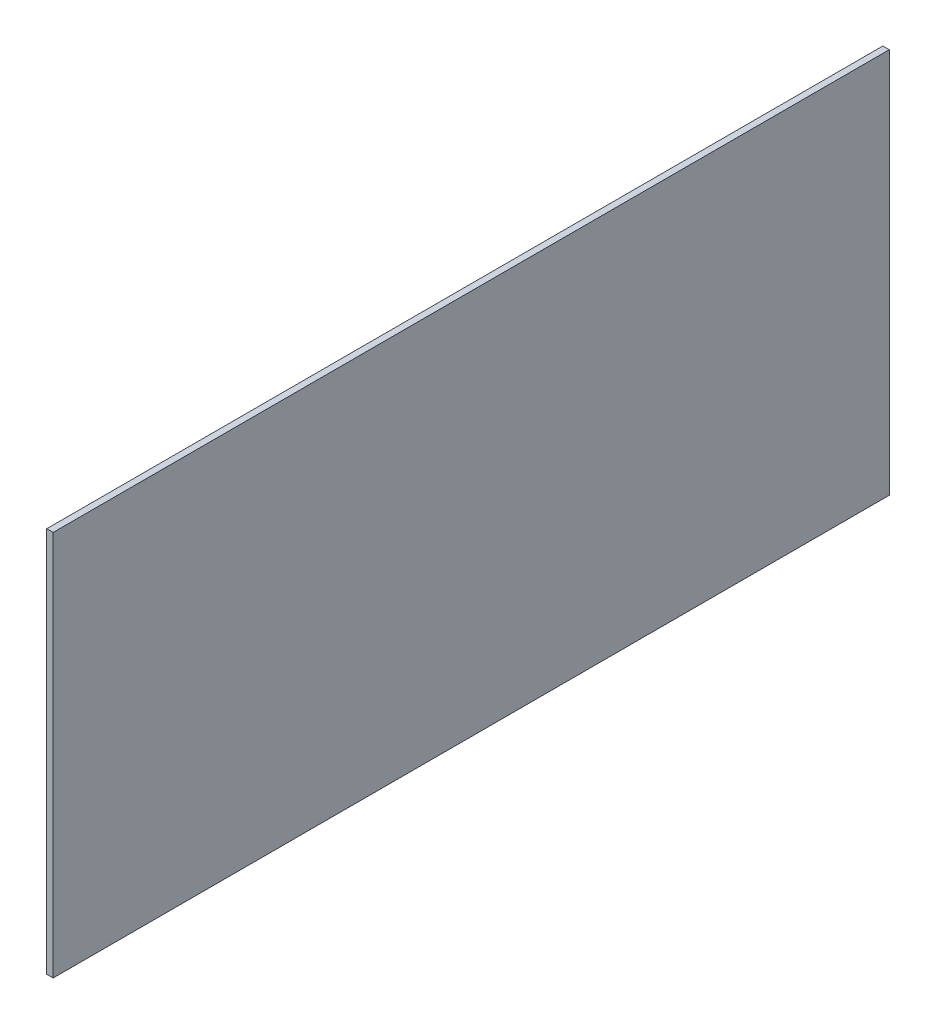
ISO-10303-21;
HEADER;
FILE_DESCRIPTION(('STEP AP214'),'2;1');
FILE_NAME('part.step','',(''),(''),'','','');
FILE_SCHEMA(('AUTOMOTIVE_DESIGN { 1 0 10303 214 1 1 1 1 }'));
ENDSEC;
DATA;
#1=APPLICATION_CONTEXT('core data for automotive mechanical design processes');
#2=APPLICATION_PROTOCOL_DEFINITION('international standard','automotive_design',2000,#1);
#3=PRODUCT_CONTEXT('',#1,'mechanical');
#4=PRODUCT('Part','Part','',(#3));
#5=PRODUCT_RELATED_PRODUCT_CATEGORY('part','',(#4));
#6=PRODUCT_DEFINITION_FORMATION('','',#4);
#7=PRODUCT_DEFINITION_CONTEXT('part definition',#1,'design');
#8=PRODUCT_DEFINITION('design','',#6,#7);
#9=PRODUCT_DEFINITION_SHAPE('','',#8);
#10=(LENGTH_UNIT() NAMED_UNIT(*) SI_UNIT(.MILLI.,.METRE.));
#11=(NAMED_UNIT(*) PLANE_ANGLE_UNIT() SI_UNIT($,.RADIAN.));
#12=(NAMED_UNIT(*) SI_UNIT($,.STERADIAN.) SOLID_ANGLE_UNIT());
#13=UNCERTAINTY_MEASURE_WITH_UNIT(LENGTH_MEASURE(1.E-05),#10,'distance_accuracy_value','');
#14=(GEOMETRIC_REPRESENTATION_CONTEXT(3) GLOBAL_UNCERTAINTY_ASSIGNED_CONTEXT((#13)) GLOBAL_UNIT_ASSIGNED_CONTEXT((#10,
#11,#12)) REPRESENTATION_CONTEXT('',''));
#15=CARTESIAN_POINT('',(0.,0.,0.));
#16=DIRECTION('',(0.,0.,1.));
#17=DIRECTION('',(1.,0.,0.));
#18=AXIS2_PLACEMENT_3D('',#15,#16,#17);
#19=CARTESIAN_POINT('',(1.,9.98105152963319,33.853534625365));
#20=DIRECTION('',(0.,0.,-1.));
#21=DIRECTION('',(0.,1.,0.));
#22=AXIS2_PLACEMENT_3D('',#19,#20,#21);
#23=PLANE('',#22);
#24=DIRECTION('',(0.,-1.,0.));
#25=VECTOR('',#24,1.);
#26=CARTESIAN_POINT('',(0.,9.98105152963319,33.853534625365));
#27=LINE('',#26,#25);
#28=CARTESIAN_POINT('',(0.,9.98105152963319,33.853534625365));
#29=VERTEX_POINT('',#28);
#30=CARTESIAN_POINT('',(0.,-50.0189484703668,33.853534625365));
#31=VERTEX_POINT('',#30);
#32=EDGE_CURVE('E95',#29,#31,#27,.T.);
#33=ORIENTED_EDGE('',*,*,#32,.T.);
#34=DIRECTION('',(-1.,0.,0.));
#35=VECTOR('',#34,1.);
#36=CARTESIAN_POINT('',(1.,-50.0189484703668,33.853534625365));
#37=LINE('',#36,#35);
#38=CARTESIAN_POINT('',(1.,-50.0189484703668,33.853534625365));
#39=VERTEX_POINT('',#38);
#40=EDGE_CURVE('E11',#39,#31,#37,.T.);
#41=ORIENTED_EDGE('',*,*,#40,.F.);
#42=DIRECTION('',(0.,-1.,0.));
#43=VECTOR('',#42,1.);
#44=CARTESIAN_POINT('',(1.,9.98105152963319,33.853534625365));
#45=LINE('',#44,#43);
#46=CARTESIAN_POINT('',(1.,9.98105152963319,33.853534625365));
#47=VERTEX_POINT('',#46);
#48=EDGE_CURVE('E83',#47,#39,#45,.T.);
#49=ORIENTED_EDGE('',*,*,#48,.F.);
#50=DIRECTION('',(-1.,0.,0.));
#51=VECTOR('',#50,1.);
#52=CARTESIAN_POINT('',(1.,9.98105152963319,33.853534625365));
#53=LINE('',#52,#51);
#54=EDGE_CURVE('E91',#47,#29,#53,.T.);
#55=ORIENTED_EDGE('',*,*,#54,.T.);
#56=EDGE_LOOP('',(#33,#41,#49,#55));
#57=FACE_BOUND('',#56,.T.);
#58=ADVANCED_FACE('F32',(#57),#23,.F.);
#59=CARTESIAN_POINT('',(1.,-50.0189484703668,33.853534625365));
#60=DIRECTION('',(0.,1.,0.));
#61=DIRECTION('',(0.,0.,1.));
#62=AXIS2_PLACEMENT_3D('',#59,#60,#61);
#63=PLANE('',#62);
#64=DIRECTION('',(0.,0.,-1.));
#65=VECTOR('',#64,1.);
#66=CARTESIAN_POINT('',(0.,-50.0189484703668,33.853534625365));
#67=LINE('',#66,#65);
#68=CARTESIAN_POINT('',(0.,-50.0189484703668,-96.146465374635));
#69=VERTEX_POINT('',#68);
#70=EDGE_CURVE('E87',#31,#69,#67,.T.);
#71=ORIENTED_EDGE('',*,*,#70,.T.);
#72=DIRECTION('',(-1.,0.,0.));
#73=VECTOR('',#72,1.);
#74=CARTESIAN_POINT('',(1.,-50.0189484703668,-96.146465374635));
#75=LINE('',#74,#73);
#76=CARTESIAN_POINT('',(1.,-50.0189484703668,-96.146465374635));
#77=VERTEX_POINT('',#76);
#78=EDGE_CURVE('E40',#77,#69,#75,.T.);
#79=ORIENTED_EDGE('',*,*,#78,.F.);
#80=DIRECTION('',(0.,0.,-1.));
#81=VECTOR('',#80,1.);
#82=CARTESIAN_POINT('',(1.,-50.0189484703668,33.853534625365));
#83=LINE('',#82,#81);
#84=EDGE_CURVE('E78',#39,#77,#83,.T.);
#85=ORIENTED_EDGE('',*,*,#84,.F.);
#86=ORIENTED_EDGE('',*,*,#40,.T.);
#87=EDGE_LOOP('',(#71,#79,#85,#86));
#88=FACE_BOUND('',#87,.T.);
#89=ADVANCED_FACE('F86',(#88),#63,.F.);
#90=CARTESIAN_POINT('',(1.,9.98105152963319,-96.146465374635));
#91=DIRECTION('',(0.,0.,1.));
#92=DIRECTION('',(1.,0.,0.));
#93=AXIS2_PLACEMENT_3D('',#90,#91,#92);
#94=PLANE('',#93);
#95=DIRECTION('',(0.,1.,0.));
#96=VECTOR('',#95,1.);
#97=CARTESIAN_POINT('',(0.,9.98105152963319,-96.146465374635));
#98=LINE('',#97,#96);
#99=CARTESIAN_POINT('',(0.,9.98105152963319,-96.146465374635));
#100=VERTEX_POINT('',#99);
#101=EDGE_CURVE('E65',#69,#100,#98,.T.);
#102=ORIENTED_EDGE('',*,*,#101,.T.);
#103=DIRECTION('',(-1.,0.,0.));
#104=VECTOR('',#103,1.);
#105=CARTESIAN_POINT('',(1.,9.98105152963319,-96.146465374635));
#106=LINE('',#105,#104);
#107=CARTESIAN_POINT('',(1.,9.98105152963319,-96.146465374635));
#108=VERTEX_POINT('',#107);
#109=EDGE_CURVE('E88',#108,#100,#106,.T.);
#110=ORIENTED_EDGE('',*,*,#109,.F.);
#111=DIRECTION('',(0.,1.,0.));
#112=VECTOR('',#111,1.);
#113=CARTESIAN_POINT('',(1.,9.98105152963319,-96.146465374635));
#114=LINE('',#113,#112);
#115=EDGE_CURVE('E81',#77,#108,#114,.T.);
#116=ORIENTED_EDGE('',*,*,#115,.F.);
#117=ORIENTED_EDGE('',*,*,#78,.T.);
#118=EDGE_LOOP('',(#102,#110,#116,#117));
#119=FACE_BOUND('',#118,.T.);
#120=ADVANCED_FACE('F89',(#119),#94,.F.);
#121=CARTESIAN_POINT('',(1.,9.98105152963319,33.853534625365));
#122=DIRECTION('',(0.,-1.,0.));
#123=DIRECTION('',(0.,0.,-1.));
#124=AXIS2_PLACEMENT_3D('',#121,#122,#123);
#125=PLANE('',#124);
#126=DIRECTION('',(0.,0.,1.));
#127=VECTOR('',#126,1.);
#128=CARTESIAN_POINT('',(0.,9.98105152963319,33.853534625365));
#129=LINE('',#128,#127);
#130=EDGE_CURVE('E71',#100,#29,#129,.T.);
#131=ORIENTED_EDGE('',*,*,#130,.T.);
#132=ORIENTED_EDGE('',*,*,#54,.F.);
#133=DIRECTION('',(0.,0.,1.));
#134=VECTOR('',#133,1.);
#135=CARTESIAN_POINT('',(1.,9.98105152963319,33.853534625365));
#136=LINE('',#135,#134);
#137=EDGE_CURVE('E48',#108,#47,#136,.T.);
#138=ORIENTED_EDGE('',*,*,#137,.F.);
#139=ORIENTED_EDGE('',*,*,#109,.T.);
#140=EDGE_LOOP('',(#131,#132,#138,#139));
#141=FACE_BOUND('',#140,.T.);
#142=ADVANCED_FACE('F102',(#141),#125,.F.);
#143=CARTESIAN_POINT('',(1.,-50.0189484703668,33.853534625365));
#144=DIRECTION('',(1.,0.,0.));
#145=DIRECTION('',(0.,0.,-1.));
#146=AXIS2_PLACEMENT_3D('',#143,#144,#145);
#147=PLANE('',#146);
#148=ORIENTED_EDGE('',*,*,#48,.T.);
#149=ORIENTED_EDGE('',*,*,#84,.T.);
#150=ORIENTED_EDGE('',*,*,#115,.T.);
#151=ORIENTED_EDGE('',*,*,#137,.T.);
#152=EDGE_LOOP('',(#148,#149,#150,#151));
#153=FACE_BOUND('',#152,.T.);
#154=ADVANCED_FACE('F79',(#153),#147,.T.);
#155=CARTESIAN_POINT('',(0.,-50.0189484703668,33.853534625365));
#156=DIRECTION('',(1.,0.,0.));
#157=DIRECTION('',(0.,0.,-1.));
#158=AXIS2_PLACEMENT_3D('',#155,#156,#157);
#159=PLANE('',#158);
#160=ORIENTED_EDGE('',*,*,#32,.F.);
#161=ORIENTED_EDGE('',*,*,#130,.F.);
#162=ORIENTED_EDGE('',*,*,#101,.F.);
#163=ORIENTED_EDGE('',*,*,#70,.F.);
#164=EDGE_LOOP('',(#160,#161,#162,#163));
#165=FACE_BOUND('',#164,.T.);
#166=ADVANCED_FACE('F105',(#165),#159,.F.);
#167=CLOSED_SHELL('',(#58,#89,#120,#142,#154,#166));
#168=MANIFOLD_SOLID_BREP('B2',#167);
#169=ADVANCED_BREP_SHAPE_REPRESENTATION('',(#18,#168),#14);
#170=SHAPE_DEFINITION_REPRESENTATION(#9,#169);
ENDSEC;
END-ISO-10303-21;
